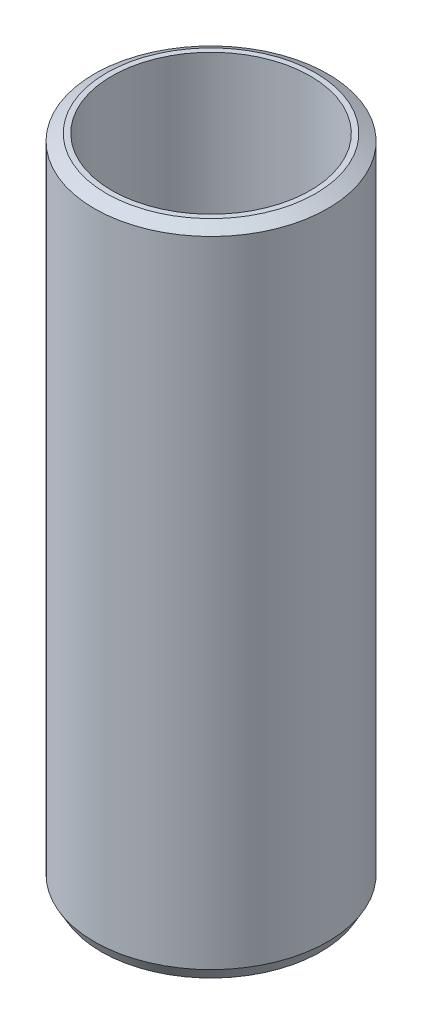
ISO-10303-21;
HEADER;
FILE_DESCRIPTION(('STEP AP214'),'2;1');
FILE_NAME('part.step','',(''),(''),'','','');
FILE_SCHEMA(('AUTOMOTIVE_DESIGN { 1 0 10303 214 1 1 1 1 }'));
ENDSEC;
DATA;
#1=APPLICATION_CONTEXT('core data for automotive mechanical design processes');
#2=APPLICATION_PROTOCOL_DEFINITION('international standard','automotive_design',2000,#1);
#3=PRODUCT_CONTEXT('',#1,'mechanical');
#4=PRODUCT('Part','Part','',(#3));
#5=PRODUCT_RELATED_PRODUCT_CATEGORY('part','',(#4));
#6=PRODUCT_DEFINITION_FORMATION('','',#4);
#7=PRODUCT_DEFINITION_CONTEXT('part definition',#1,'design');
#8=PRODUCT_DEFINITION('design','',#6,#7);
#9=PRODUCT_DEFINITION_SHAPE('','',#8);
#10=(LENGTH_UNIT() NAMED_UNIT(*) SI_UNIT(.MILLI.,.METRE.));
#11=(NAMED_UNIT(*) PLANE_ANGLE_UNIT() SI_UNIT($,.RADIAN.));
#12=(NAMED_UNIT(*) SI_UNIT($,.STERADIAN.) SOLID_ANGLE_UNIT());
#13=UNCERTAINTY_MEASURE_WITH_UNIT(LENGTH_MEASURE(1.E-05),#10,'distance_accuracy_value','');
#14=(GEOMETRIC_REPRESENTATION_CONTEXT(3) GLOBAL_UNCERTAINTY_ASSIGNED_CONTEXT((#13)) GLOBAL_UNIT_ASSIGNED_CONTEXT((#10,
#11,#12)) REPRESENTATION_CONTEXT('',''));
#15=CARTESIAN_POINT('',(0.,0.,0.));
#16=DIRECTION('',(0.,0.,1.));
#17=DIRECTION('',(1.,0.,0.));
#18=AXIS2_PLACEMENT_3D('',#15,#16,#17);
#19=CARTESIAN_POINT('',(0.,308.205742816553,0.));
#20=DIRECTION('',(0.,-1.,0.));
#21=DIRECTION('',(0.,0.,-1.));
#22=AXIS2_PLACEMENT_3D('',#19,#20,#21);
#23=CYLINDRICAL_SURFACE('',#22,55.);
#24=CARTESIAN_POINT('',(0.,304.950427226676,0.));
#25=DIRECTION('',(0.,1.,0.));
#26=DIRECTION('',(0.,0.,1.));
#27=AXIS2_PLACEMENT_3D('',#24,#25,#26);
#28=CIRCLE('',#27,55.);
#29=CARTESIAN_POINT('',(0.,304.950427226676,55.));
#30=VERTEX_POINT('',#29);
#31=EDGE_CURVE('E50',#30,#30,#28,.F.);
#32=ORIENTED_EDGE('',*,*,#31,.T.);
#33=EDGE_LOOP('',(#32));
#34=FACE_BOUND('',#33,.T.);
#35=CARTESIAN_POINT('',(0.,5.73030706691718,0.));
#36=DIRECTION('',(0.,1.,0.));
#37=DIRECTION('',(0.,0.,1.));
#38=AXIS2_PLACEMENT_3D('',#35,#36,#37);
#39=CIRCLE('',#38,55.);
#40=CARTESIAN_POINT('',(0.,5.73030706691718,55.));
#41=VERTEX_POINT('',#40);
#42=EDGE_CURVE('E51',#41,#41,#39,.T.);
#43=ORIENTED_EDGE('',*,*,#42,.T.);
#44=EDGE_LOOP('',(#43));
#45=FACE_BOUND('',#44,.T.);
#46=ADVANCED_FACE('F39',(#34,#45),#23,.T.);
#47=CARTESIAN_POINT('',(0.,308.205742816553,0.));
#48=DIRECTION('',(0.,1.,0.));
#49=DIRECTION('',(0.,0.,1.));
#50=AXIS2_PLACEMENT_3D('',#47,#48,#49);
#51=PLANE('',#50);
#52=CARTESIAN_POINT('',(0.,308.205742816553,0.));
#53=DIRECTION('',(0.,1.,0.));
#54=DIRECTION('',(0.,0.,1.));
#55=AXIS2_PLACEMENT_3D('',#52,#53,#54);
#56=CIRCLE('',#55,49.2696929330831);
#57=CARTESIAN_POINT('',(0.,308.205742816553,49.2696929330831));
#58=VERTEX_POINT('',#57);
#59=EDGE_CURVE('E54',#58,#58,#56,.T.);
#60=ORIENTED_EDGE('',*,*,#59,.T.);
#61=EDGE_LOOP('',(#60));
#62=FACE_BOUND('',#61,.T.);
#63=CARTESIAN_POINT('',(0.,308.205742816553,0.));
#64=DIRECTION('',(0.,1.,0.));
#65=DIRECTION('',(0.,0.,1.));
#66=AXIS2_PLACEMENT_3D('',#63,#64,#65);
#67=CIRCLE('',#66,46.758257788417);
#68=CARTESIAN_POINT('',(0.,308.205742816553,46.758257788417));
#69=VERTEX_POINT('',#68);
#70=EDGE_CURVE('E58',#69,#69,#67,.T.);
#71=ORIENTED_EDGE('',*,*,#70,.F.);
#72=EDGE_LOOP('',(#71));
#73=FACE_BOUND('',#72,.T.);
#74=ADVANCED_FACE('F69',(#62,#73),#51,.T.);
#75=CARTESIAN_POINT('',(0.,0.,0.));
#76=DIRECTION('',(0.,1.,0.));
#77=DIRECTION('',(0.,0.,1.));
#78=AXIS2_PLACEMENT_3D('',#75,#76,#77);
#79=PLANE('',#78);
#80=CARTESIAN_POINT('',(0.,0.,0.));
#81=DIRECTION('',(0.,1.,0.));
#82=DIRECTION('',(0.,0.,1.));
#83=AXIS2_PLACEMENT_3D('',#80,#81,#82);
#84=CIRCLE('',#83,51.7446844101228);
#85=CARTESIAN_POINT('',(0.,0.,51.7446844101228));
#86=VERTEX_POINT('',#85);
#87=EDGE_CURVE('E10',#86,#86,#84,.F.);
#88=ORIENTED_EDGE('',*,*,#87,.T.);
#89=EDGE_LOOP('',(#88));
#90=FACE_BOUND('',#89,.T.);
#91=CARTESIAN_POINT('',(0.,0.,0.));
#92=DIRECTION('',(0.,1.,0.));
#93=DIRECTION('',(0.,0.,1.));
#94=AXIS2_PLACEMENT_3D('',#91,#92,#93);
#95=CIRCLE('',#94,46.758257788417);
#96=CARTESIAN_POINT('',(0.,0.,46.758257788417));
#97=VERTEX_POINT('',#96);
#98=EDGE_CURVE('E63',#97,#97,#95,.T.);
#99=ORIENTED_EDGE('',*,*,#98,.T.);
#100=EDGE_LOOP('',(#99));
#101=FACE_BOUND('',#100,.T.);
#102=ADVANCED_FACE('F75',(#90,#101),#79,.F.);
#103=CARTESIAN_POINT('',(0.,308.205742816553,0.));
#104=DIRECTION('',(0.,-1.,0.));
#105=DIRECTION('',(0.,0.,-1.));
#106=AXIS2_PLACEMENT_3D('',#103,#104,#105);
#107=CYLINDRICAL_SURFACE('',#106,46.758257788417);
#108=ORIENTED_EDGE('',*,*,#70,.T.);
#109=EDGE_LOOP('',(#108));
#110=FACE_BOUND('',#109,.T.);
#111=ORIENTED_EDGE('',*,*,#98,.F.);
#112=EDGE_LOOP('',(#111));
#113=FACE_BOUND('',#112,.T.);
#114=ADVANCED_FACE('F70',(#110,#113),#107,.F.);
#115=CARTESIAN_POINT('',(0.,308.205742816553,0.));
#116=DIRECTION('',(0.,-1.,0.));
#117=DIRECTION('',(0.,0.,-1.));
#118=AXIS2_PLACEMENT_3D('',#115,#116,#117);
#119=CONICAL_SURFACE('',#118,49.2696929330831,1.05417252101127);
#120=ORIENTED_EDGE('',*,*,#31,.F.);
#121=EDGE_LOOP('',(#120));
#122=FACE_BOUND('',#121,.T.);
#123=ORIENTED_EDGE('',*,*,#59,.F.);
#124=EDGE_LOOP('',(#123));
#125=FACE_BOUND('',#124,.T.);
#126=ADVANCED_FACE('F81',(#122,#125),#119,.T.);
#127=CARTESIAN_POINT('',(0.,5.73030706691718,0.));
#128=DIRECTION('',(0.,1.,0.));
#129=DIRECTION('',(0.,0.,1.));
#130=AXIS2_PLACEMENT_3D('',#127,#128,#129);
#131=CONICAL_SURFACE('',#130,55.,0.516623805783624);
#132=ORIENTED_EDGE('',*,*,#87,.F.);
#133=EDGE_LOOP('',(#132));
#134=FACE_BOUND('',#133,.T.);
#135=ORIENTED_EDGE('',*,*,#42,.F.);
#136=EDGE_LOOP('',(#135));
#137=FACE_BOUND('',#136,.T.);
#138=ADVANCED_FACE('F45',(#134,#137),#131,.T.);
#139=CLOSED_SHELL('',(#46,#74,#102,#114,#126,#138));
#140=MANIFOLD_SOLID_BREP('B2',#139);
#141=ADVANCED_BREP_SHAPE_REPRESENTATION('',(#18,#140),#14);
#142=SHAPE_DEFINITION_REPRESENTATION(#9,#141);
ENDSEC;
END-ISO-10303-21;
